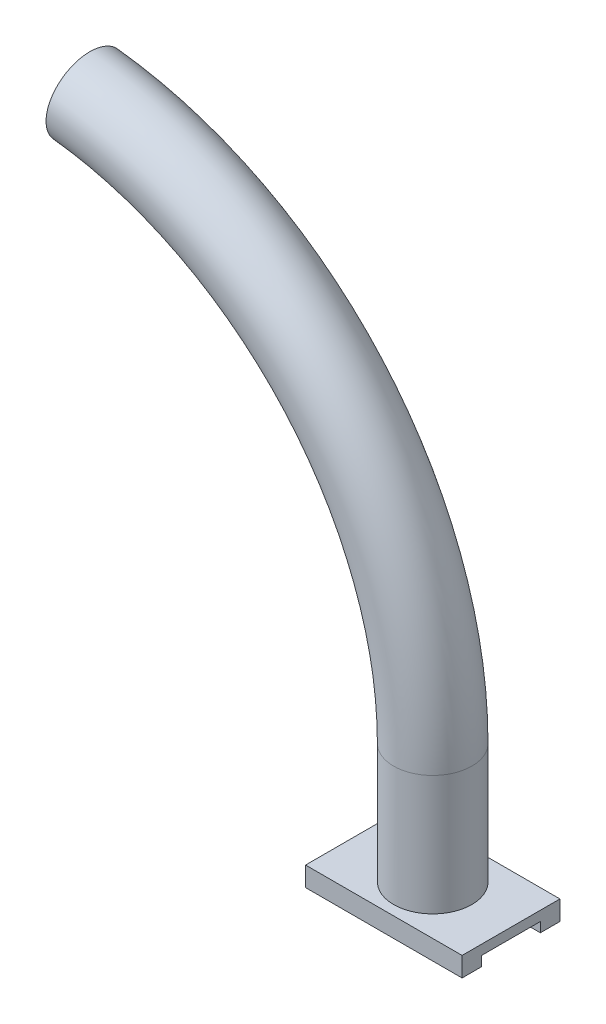
ISO-10303-21;
HEADER;
FILE_DESCRIPTION(('STEP AP214'),'2;1');
FILE_NAME('part.step','',(''),(''),'','','');
FILE_SCHEMA(('AUTOMOTIVE_DESIGN { 1 0 10303 214 1 1 1 1 }'));
ENDSEC;
DATA;
#1=APPLICATION_CONTEXT('core data for automotive mechanical design processes');
#2=APPLICATION_PROTOCOL_DEFINITION('international standard','automotive_design',2000,#1);
#3=PRODUCT_CONTEXT('',#1,'mechanical');
#4=PRODUCT('Part','Part','',(#3));
#5=PRODUCT_RELATED_PRODUCT_CATEGORY('part','',(#4));
#6=PRODUCT_DEFINITION_FORMATION('','',#4);
#7=PRODUCT_DEFINITION_CONTEXT('part definition',#1,'design');
#8=PRODUCT_DEFINITION('design','',#6,#7);
#9=PRODUCT_DEFINITION_SHAPE('','',#8);
#10=(LENGTH_UNIT() NAMED_UNIT(*) SI_UNIT(.MILLI.,.METRE.));
#11=(NAMED_UNIT(*) PLANE_ANGLE_UNIT() SI_UNIT($,.RADIAN.));
#12=(NAMED_UNIT(*) SI_UNIT($,.STERADIAN.) SOLID_ANGLE_UNIT());
#13=UNCERTAINTY_MEASURE_WITH_UNIT(LENGTH_MEASURE(1.E-05),#10,'distance_accuracy_value','');
#14=(GEOMETRIC_REPRESENTATION_CONTEXT(3) GLOBAL_UNCERTAINTY_ASSIGNED_CONTEXT((#13)) GLOBAL_UNIT_ASSIGNED_CONTEXT((#10,
#11,#12)) REPRESENTATION_CONTEXT('',''));
#15=CARTESIAN_POINT('',(0.,0.,0.));
#16=DIRECTION('',(0.,0.,1.));
#17=DIRECTION('',(1.,0.,0.));
#18=AXIS2_PLACEMENT_3D('',#15,#16,#17);
#19=CARTESIAN_POINT('',(0.,0.,0.));
#20=DIRECTION('',(0.,-1.,0.));
#21=DIRECTION('',(0.,0.,-1.));
#22=AXIS2_PLACEMENT_3D('',#19,#20,#21);
#23=PLANE('',#22);
#24=DIRECTION('',(0.,0.,1.));
#25=VECTOR('',#24,1.);
#26=CARTESIAN_POINT('',(0.,0.,0.));
#27=LINE('',#26,#25);
#28=CARTESIAN_POINT('',(0.,0.,-4.));
#29=VERTEX_POINT('',#28);
#30=CARTESIAN_POINT('',(0.,0.,-1.));
#31=VERTEX_POINT('',#30);
#32=EDGE_CURVE('E84',#29,#31,#27,.T.);
#33=ORIENTED_EDGE('',*,*,#32,.F.);
#34=DIRECTION('',(-1.,0.,0.));
#35=VECTOR('',#34,1.);
#36=CARTESIAN_POINT('',(0.,0.,-4.));
#37=LINE('',#36,#35);
#38=CARTESIAN_POINT('',(8.,0.,-4.));
#39=VERTEX_POINT('',#38);
#40=EDGE_CURVE('E127',#39,#29,#37,.T.);
#41=ORIENTED_EDGE('',*,*,#40,.F.);
#42=DIRECTION('',(0.,0.,-1.));
#43=VECTOR('',#42,1.);
#44=CARTESIAN_POINT('',(8.,0.,0.));
#45=LINE('',#44,#43);
#46=CARTESIAN_POINT('',(8.,0.,-1.));
#47=VERTEX_POINT('',#46);
#48=EDGE_CURVE('E144',#47,#39,#45,.T.);
#49=ORIENTED_EDGE('',*,*,#48,.F.);
#50=DIRECTION('',(1.,0.,0.));
#51=VECTOR('',#50,1.);
#52=CARTESIAN_POINT('',(0.,0.,-1.));
#53=LINE('',#52,#51);
#54=EDGE_CURVE('E134',#31,#47,#53,.T.);
#55=ORIENTED_EDGE('',*,*,#54,.F.);
#56=EDGE_LOOP('',(#33,#41,#49,#55));
#57=FACE_BOUND('',#56,.T.);
#58=ADVANCED_FACE('F59',(#57),#23,.T.);
#59=CARTESIAN_POINT('',(0.,0.5,0.));
#60=DIRECTION('',(1.,0.,0.));
#61=DIRECTION('',(0.,0.,-1.));
#62=AXIS2_PLACEMENT_3D('',#59,#60,#61);
#63=PLANE('',#62);
#64=DIRECTION('',(0.,-1.,0.));
#65=VECTOR('',#64,1.);
#66=CARTESIAN_POINT('',(0.,0.5,-5.));
#67=LINE('',#66,#65);
#68=CARTESIAN_POINT('',(0.,0.5,-5.));
#69=VERTEX_POINT('',#68);
#70=CARTESIAN_POINT('',(0.,-0.5,-5.));
#71=VERTEX_POINT('',#70);
#72=EDGE_CURVE('E157',#69,#71,#67,.T.);
#73=ORIENTED_EDGE('',*,*,#72,.T.);
#74=DIRECTION('',(0.,0.,-1.));
#75=VECTOR('',#74,1.);
#76=CARTESIAN_POINT('',(0.,-0.5,-4.));
#77=LINE('',#76,#75);
#78=CARTESIAN_POINT('',(0.,-0.5,-4.));
#79=VERTEX_POINT('',#78);
#80=EDGE_CURVE('E135',#79,#71,#77,.T.);
#81=ORIENTED_EDGE('',*,*,#80,.F.);
#82=DIRECTION('',(0.,1.,0.));
#83=VECTOR('',#82,1.);
#84=CARTESIAN_POINT('',(0.,-0.5,-4.));
#85=LINE('',#84,#83);
#86=EDGE_CURVE('E129',#79,#29,#85,.T.);
#87=ORIENTED_EDGE('',*,*,#86,.T.);
#88=ORIENTED_EDGE('',*,*,#32,.T.);
#89=DIRECTION('',(0.,1.,0.));
#90=VECTOR('',#89,1.);
#91=CARTESIAN_POINT('',(0.,-0.5,-1.));
#92=LINE('',#91,#90);
#93=CARTESIAN_POINT('',(0.,-0.5,-1.));
#94=VERTEX_POINT('',#93);
#95=EDGE_CURVE('E145',#94,#31,#92,.T.);
#96=ORIENTED_EDGE('',*,*,#95,.F.);
#97=DIRECTION('',(0.,0.,-1.));
#98=VECTOR('',#97,1.);
#99=CARTESIAN_POINT('',(0.,-0.5,0.));
#100=LINE('',#99,#98);
#101=CARTESIAN_POINT('',(0.,-0.5,0.));
#102=VERTEX_POINT('',#101);
#103=EDGE_CURVE('E183',#102,#94,#100,.T.);
#104=ORIENTED_EDGE('',*,*,#103,.F.);
#105=DIRECTION('',(0.,-1.,0.));
#106=VECTOR('',#105,1.);
#107=CARTESIAN_POINT('',(0.,0.5,0.));
#108=LINE('',#107,#106);
#109=CARTESIAN_POINT('',(0.,0.5,0.));
#110=VERTEX_POINT('',#109);
#111=EDGE_CURVE('E63',#110,#102,#108,.T.);
#112=ORIENTED_EDGE('',*,*,#111,.F.);
#113=DIRECTION('',(0.,0.,1.));
#114=VECTOR('',#113,1.);
#115=CARTESIAN_POINT('',(0.,0.5,0.));
#116=LINE('',#115,#114);
#117=EDGE_CURVE('E149',#69,#110,#116,.T.);
#118=ORIENTED_EDGE('',*,*,#117,.F.);
#119=EDGE_LOOP('',(#73,#81,#87,#88,#96,#104,#112,#118));
#120=FACE_BOUND('',#119,.T.);
#121=ADVANCED_FACE('F61',(#120),#63,.F.);
#122=CARTESIAN_POINT('',(0.,0.5,0.));
#123=DIRECTION('',(0.,0.,-1.));
#124=DIRECTION('',(-1.,0.,0.));
#125=AXIS2_PLACEMENT_3D('',#122,#123,#124);
#126=PLANE('',#125);
#127=ORIENTED_EDGE('',*,*,#111,.T.);
#128=DIRECTION('',(-1.,0.,0.));
#129=VECTOR('',#128,1.);
#130=CARTESIAN_POINT('',(0.,-0.5,0.));
#131=LINE('',#130,#129);
#132=CARTESIAN_POINT('',(8.,-0.5,0.));
#133=VERTEX_POINT('',#132);
#134=EDGE_CURVE('E175',#133,#102,#131,.T.);
#135=ORIENTED_EDGE('',*,*,#134,.F.);
#136=DIRECTION('',(0.,-1.,0.));
#137=VECTOR('',#136,1.);
#138=CARTESIAN_POINT('',(8.,0.5,0.));
#139=LINE('',#138,#137);
#140=CARTESIAN_POINT('',(8.,0.5,0.));
#141=VERTEX_POINT('',#140);
#142=EDGE_CURVE('E162',#141,#133,#139,.T.);
#143=ORIENTED_EDGE('',*,*,#142,.F.);
#144=DIRECTION('',(1.,0.,0.));
#145=VECTOR('',#144,1.);
#146=CARTESIAN_POINT('',(0.,0.5,0.));
#147=LINE('',#146,#145);
#148=EDGE_CURVE('E176',#110,#141,#147,.T.);
#149=ORIENTED_EDGE('',*,*,#148,.F.);
#150=EDGE_LOOP('',(#127,#135,#143,#149));
#151=FACE_BOUND('',#150,.T.);
#152=ADVANCED_FACE('F174',(#151),#126,.F.);
#153=CARTESIAN_POINT('',(8.,0.5,0.));
#154=DIRECTION('',(-1.,0.,0.));
#155=DIRECTION('',(0.,0.,1.));
#156=AXIS2_PLACEMENT_3D('',#153,#154,#155);
#157=PLANE('',#156);
#158=ORIENTED_EDGE('',*,*,#142,.T.);
#159=DIRECTION('',(0.,0.,1.));
#160=VECTOR('',#159,1.);
#161=CARTESIAN_POINT('',(8.,-0.5,0.));
#162=LINE('',#161,#160);
#163=CARTESIAN_POINT('',(8.,-0.5,-1.));
#164=VERTEX_POINT('',#163);
#165=EDGE_CURVE('E184',#164,#133,#162,.T.);
#166=ORIENTED_EDGE('',*,*,#165,.F.);
#167=DIRECTION('',(0.,1.,0.));
#168=VECTOR('',#167,1.);
#169=CARTESIAN_POINT('',(8.,-0.5,-1.));
#170=LINE('',#169,#168);
#171=EDGE_CURVE('E151',#164,#47,#170,.T.);
#172=ORIENTED_EDGE('',*,*,#171,.T.);
#173=ORIENTED_EDGE('',*,*,#48,.T.);
#174=DIRECTION('',(0.,1.,0.));
#175=VECTOR('',#174,1.);
#176=CARTESIAN_POINT('',(8.,-0.5,-4.));
#177=LINE('',#176,#175);
#178=CARTESIAN_POINT('',(8.,-0.5,-4.));
#179=VERTEX_POINT('',#178);
#180=EDGE_CURVE('E76',#179,#39,#177,.T.);
#181=ORIENTED_EDGE('',*,*,#180,.F.);
#182=DIRECTION('',(0.,0.,1.));
#183=VECTOR('',#182,1.);
#184=CARTESIAN_POINT('',(8.,-0.5,-4.));
#185=LINE('',#184,#183);
#186=CARTESIAN_POINT('',(8.,-0.5,-5.));
#187=VERTEX_POINT('',#186);
#188=EDGE_CURVE('E221',#187,#179,#185,.T.);
#189=ORIENTED_EDGE('',*,*,#188,.F.);
#190=DIRECTION('',(0.,-1.,0.));
#191=VECTOR('',#190,1.);
#192=CARTESIAN_POINT('',(8.,0.5,-5.));
#193=LINE('',#192,#191);
#194=CARTESIAN_POINT('',(8.,0.5,-5.));
#195=VERTEX_POINT('',#194);
#196=EDGE_CURVE('E160',#195,#187,#193,.T.);
#197=ORIENTED_EDGE('',*,*,#196,.F.);
#198=DIRECTION('',(0.,0.,-1.));
#199=VECTOR('',#198,1.);
#200=CARTESIAN_POINT('',(8.,0.5,0.));
#201=LINE('',#200,#199);
#202=EDGE_CURVE('E205',#141,#195,#201,.T.);
#203=ORIENTED_EDGE('',*,*,#202,.F.);
#204=EDGE_LOOP('',(#158,#166,#172,#173,#181,#189,#197,#203));
#205=FACE_BOUND('',#204,.T.);
#206=ADVANCED_FACE('F265',(#205),#157,.F.);
#207=CARTESIAN_POINT('',(0.,0.5,-5.));
#208=DIRECTION('',(0.,0.,1.));
#209=DIRECTION('',(1.,0.,0.));
#210=AXIS2_PLACEMENT_3D('',#207,#208,#209);
#211=PLANE('',#210);
#212=ORIENTED_EDGE('',*,*,#196,.T.);
#213=DIRECTION('',(1.,0.,0.));
#214=VECTOR('',#213,1.);
#215=CARTESIAN_POINT('',(0.,-0.5,-5.));
#216=LINE('',#215,#214);
#217=EDGE_CURVE('E217',#71,#187,#216,.T.);
#218=ORIENTED_EDGE('',*,*,#217,.F.);
#219=ORIENTED_EDGE('',*,*,#72,.F.);
#220=DIRECTION('',(-1.,0.,0.));
#221=VECTOR('',#220,1.);
#222=CARTESIAN_POINT('',(0.,0.5,-5.));
#223=LINE('',#222,#221);
#224=EDGE_CURVE('E154',#195,#69,#223,.T.);
#225=ORIENTED_EDGE('',*,*,#224,.F.);
#226=EDGE_LOOP('',(#212,#218,#219,#225));
#227=FACE_BOUND('',#226,.T.);
#228=ADVANCED_FACE('F215',(#227),#211,.F.);
#229=CARTESIAN_POINT('',(0.,0.5,0.));
#230=DIRECTION('',(0.,-1.,0.));
#231=DIRECTION('',(0.,0.,-1.));
#232=AXIS2_PLACEMENT_3D('',#229,#230,#231);
#233=PLANE('',#232);
#234=CARTESIAN_POINT('',(4.,0.5,-2.5));
#235=DIRECTION('',(0.,1.,0.));
#236=DIRECTION('',(0.,0.,1.));
#237=AXIS2_PLACEMENT_3D('',#234,#235,#236);
#238=CIRCLE('',#237,2.);
#239=CARTESIAN_POINT('',(4.,0.5,-0.499999999999998));
#240=VERTEX_POINT('',#239);
#241=EDGE_CURVE('E12',#240,#240,#238,.T.);
#242=ORIENTED_EDGE('',*,*,#241,.F.);
#243=EDGE_LOOP('',(#242));
#244=FACE_BOUND('',#243,.T.);
#245=ORIENTED_EDGE('',*,*,#117,.T.);
#246=ORIENTED_EDGE('',*,*,#148,.T.);
#247=ORIENTED_EDGE('',*,*,#202,.T.);
#248=ORIENTED_EDGE('',*,*,#224,.T.);
#249=EDGE_LOOP('',(#245,#246,#247,#248));
#250=FACE_BOUND('',#249,.T.);
#251=ADVANCED_FACE('F212',(#244,#250),#233,.F.);
#252=CARTESIAN_POINT('',(0.,-0.5,-1.));
#253=DIRECTION('',(0.,0.,1.));
#254=DIRECTION('',(1.,0.,0.));
#255=AXIS2_PLACEMENT_3D('',#252,#253,#254);
#256=PLANE('',#255);
#257=ORIENTED_EDGE('',*,*,#54,.T.);
#258=ORIENTED_EDGE('',*,*,#171,.F.);
#259=DIRECTION('',(1.,0.,0.));
#260=VECTOR('',#259,1.);
#261=CARTESIAN_POINT('',(0.,-0.5,-1.));
#262=LINE('',#261,#260);
#263=EDGE_CURVE('E188',#94,#164,#262,.T.);
#264=ORIENTED_EDGE('',*,*,#263,.F.);
#265=ORIENTED_EDGE('',*,*,#95,.T.);
#266=EDGE_LOOP('',(#257,#258,#264,#265));
#267=FACE_BOUND('',#266,.T.);
#268=ADVANCED_FACE('F287',(#267),#256,.F.);
#269=CARTESIAN_POINT('',(0.,-0.5,0.));
#270=DIRECTION('',(0.,-1.,0.));
#271=DIRECTION('',(0.,0.,-1.));
#272=AXIS2_PLACEMENT_3D('',#269,#270,#271);
#273=PLANE('',#272);
#274=ORIENTED_EDGE('',*,*,#103,.T.);
#275=ORIENTED_EDGE('',*,*,#263,.T.);
#276=ORIENTED_EDGE('',*,*,#165,.T.);
#277=ORIENTED_EDGE('',*,*,#134,.T.);
#278=EDGE_LOOP('',(#274,#275,#276,#277));
#279=FACE_BOUND('',#278,.T.);
#280=ADVANCED_FACE('F182',(#279),#273,.T.);
#281=CARTESIAN_POINT('',(0.,-0.5,-4.));
#282=DIRECTION('',(0.,0.,-1.));
#283=DIRECTION('',(-1.,0.,0.));
#284=AXIS2_PLACEMENT_3D('',#281,#282,#283);
#285=PLANE('',#284);
#286=ORIENTED_EDGE('',*,*,#40,.T.);
#287=ORIENTED_EDGE('',*,*,#86,.F.);
#288=DIRECTION('',(-1.,0.,0.));
#289=VECTOR('',#288,1.);
#290=CARTESIAN_POINT('',(0.,-0.5,-4.));
#291=LINE('',#290,#289);
#292=EDGE_CURVE('E139',#179,#79,#291,.T.);
#293=ORIENTED_EDGE('',*,*,#292,.F.);
#294=ORIENTED_EDGE('',*,*,#180,.T.);
#295=EDGE_LOOP('',(#286,#287,#293,#294));
#296=FACE_BOUND('',#295,.T.);
#297=ADVANCED_FACE('F128',(#296),#285,.F.);
#298=CARTESIAN_POINT('',(0.,-0.5,0.));
#299=DIRECTION('',(0.,-1.,0.));
#300=DIRECTION('',(0.,0.,-1.));
#301=AXIS2_PLACEMENT_3D('',#298,#299,#300);
#302=PLANE('',#301);
#303=ORIENTED_EDGE('',*,*,#80,.T.);
#304=ORIENTED_EDGE('',*,*,#217,.T.);
#305=ORIENTED_EDGE('',*,*,#188,.T.);
#306=ORIENTED_EDGE('',*,*,#292,.T.);
#307=EDGE_LOOP('',(#303,#304,#305,#306));
#308=FACE_BOUND('',#307,.T.);
#309=ADVANCED_FACE('F222',(#308),#302,.T.);
#310=CARTESIAN_POINT('',(4.,1.5,-2.5));
#311=DIRECTION('',(0.,-1.,0.));
#312=DIRECTION('',(0.,0.,-1.));
#313=AXIS2_PLACEMENT_3D('',#310,#311,#312);
#314=CYLINDRICAL_SURFACE('',#313,2.);
#315=ORIENTED_EDGE('',*,*,#241,.T.);
#316=EDGE_LOOP('',(#315));
#317=FACE_BOUND('',#316,.T.);
#318=CARTESIAN_POINT('',(4.,6.62695122731088,-2.5));
#319=DIRECTION('',(0.,-1.,0.));
#320=DIRECTION('',(1.,0.,0.));
#321=AXIS2_PLACEMENT_3D('',#318,#319,#320);
#322=CIRCLE('',#321,2.);
#323=CARTESIAN_POINT('',(6.,6.62695122731088,-2.5));
#324=VERTEX_POINT('',#323);
#325=EDGE_CURVE('E234',#324,#324,#322,.T.);
#326=ORIENTED_EDGE('',*,*,#325,.T.);
#327=EDGE_LOOP('',(#326));
#328=FACE_BOUND('',#327,.T.);
#329=ADVANCED_FACE('F240',(#317,#328),#314,.T.);
#330=CARTESIAN_POINT('',(-13.7501261194638,26.5,-2.5));
#331=DIRECTION('',(0.993652438634457,-0.112493694026811,0.));
#332=DIRECTION('',(0.112493694026811,0.993652438634457,0.));
#333=AXIS2_PLACEMENT_3D('',#330,#331,#332);
#334=PLANE('',#333);
#335=CARTESIAN_POINT('',(-13.7501261194638,26.5,-2.5));
#336=DIRECTION('',(0.993652438634457,-0.112493694026811,0.));
#337=DIRECTION('',(0.112493694026811,0.993652438634457,0.));
#338=AXIS2_PLACEMENT_3D('',#335,#336,#337);
#339=CIRCLE('',#338,2.);
#340=CARTESIAN_POINT('',(-13.5251387314102,28.4873048772689,-2.5));
#341=VERTEX_POINT('',#340);
#342=EDGE_CURVE('E230',#341,#341,#339,.T.);
#343=ORIENTED_EDGE('',*,*,#342,.F.);
#344=EDGE_LOOP('',(#343));
#345=FACE_BOUND('',#344,.T.);
#346=ADVANCED_FACE('F244',(#345),#334,.F.);
#347=CARTESIAN_POINT('',(-16.,6.62695122731087,-2.5));
#348=DIRECTION('',(0.,0.,1.));
#349=DIRECTION('',(1.,0.,0.));
#350=AXIS2_PLACEMENT_3D('',#347,#348,#349);
#351=TOROIDAL_SURFACE('',#350,20.,2.);
#352=CARTESIAN_POINT('',(-16.,6.62695122731087,-2.5));
#353=DIRECTION('',(0.,0.,1.));
#354=DIRECTION('',(1.,0.,0.));
#355=AXIS2_PLACEMENT_3D('',#352,#353,#354);
#356=CIRCLE('',#355,22.);
#357=EDGE_CURVE('',#324,#341,#356,.T.);
#358=ORIENTED_EDGE('',*,*,#325,.F.);
#359=ORIENTED_EDGE('',*,*,#342,.T.);
#360=ORIENTED_EDGE('',*,*,#357,.T.);
#361=ORIENTED_EDGE('',*,*,#357,.F.);
#362=EDGE_LOOP('',(#358,#360,#359,#361));
#363=FACE_BOUND('',#362,.T.);
#364=ADVANCED_FACE('F242',(#363),#351,.T.);
#365=CLOSED_SHELL('',(#58,#121,#152,#206,#228,#251,#268,#280,#297,#309,#329,#346,#364));
#366=MANIFOLD_SOLID_BREP('B2',#365);
#367=ADVANCED_BREP_SHAPE_REPRESENTATION('',(#18,#366),#14);
#368=SHAPE_DEFINITION_REPRESENTATION(#9,#367);
ENDSEC;
END-ISO-10303-21;
